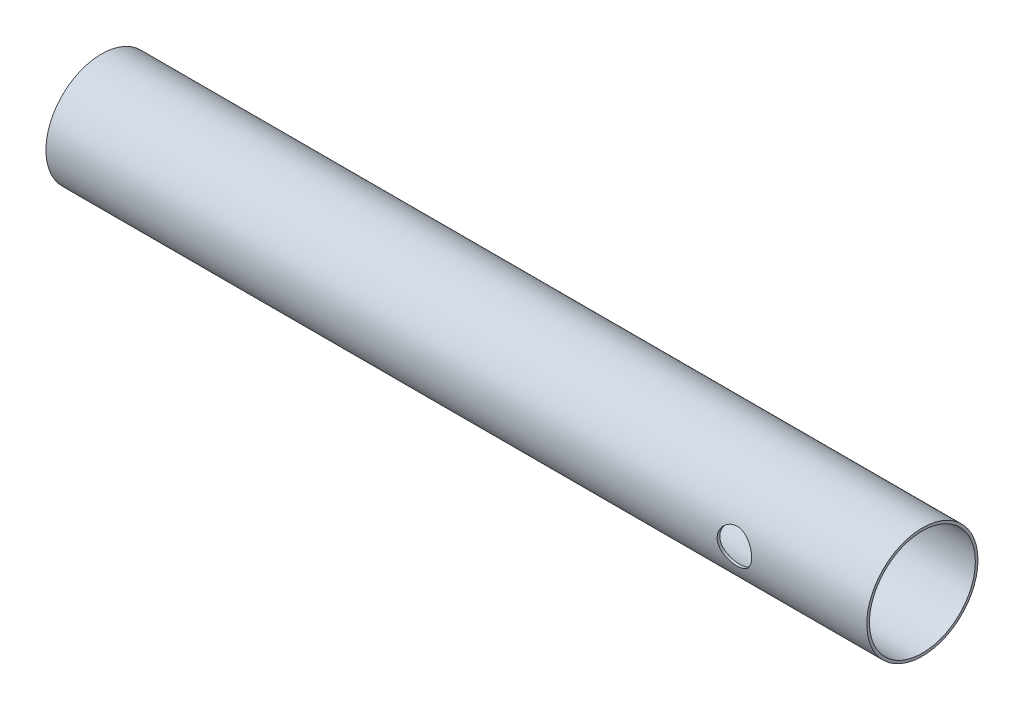
ISO-10303-21;
HEADER;
FILE_DESCRIPTION(('STEP AP214'),'2;1');
FILE_NAME('part.step','',(''),(''),'','','');
FILE_SCHEMA(('AUTOMOTIVE_DESIGN { 1 0 10303 214 1 1 1 1 }'));
ENDSEC;
DATA;
#1=APPLICATION_CONTEXT('core data for automotive mechanical design processes');
#2=APPLICATION_PROTOCOL_DEFINITION('international standard','automotive_design',2000,#1);
#3=PRODUCT_CONTEXT('',#1,'mechanical');
#4=PRODUCT('Part','Part','',(#3));
#5=PRODUCT_RELATED_PRODUCT_CATEGORY('part','',(#4));
#6=PRODUCT_DEFINITION_FORMATION('','',#4);
#7=PRODUCT_DEFINITION_CONTEXT('part definition',#1,'design');
#8=PRODUCT_DEFINITION('design','',#6,#7);
#9=PRODUCT_DEFINITION_SHAPE('','',#8);
#10=(LENGTH_UNIT() NAMED_UNIT(*) SI_UNIT(.MILLI.,.METRE.));
#11=(NAMED_UNIT(*) PLANE_ANGLE_UNIT() SI_UNIT($,.RADIAN.));
#12=(NAMED_UNIT(*) SI_UNIT($,.STERADIAN.) SOLID_ANGLE_UNIT());
#13=UNCERTAINTY_MEASURE_WITH_UNIT(LENGTH_MEASURE(1.E-05),#10,'distance_accuracy_value','');
#14=(GEOMETRIC_REPRESENTATION_CONTEXT(3) GLOBAL_UNCERTAINTY_ASSIGNED_CONTEXT((#13)) GLOBAL_UNIT_ASSIGNED_CONTEXT((#10,
#11,#12)) REPRESENTATION_CONTEXT('',''));
#15=CARTESIAN_POINT('',(0.,0.,0.));
#16=DIRECTION('',(0.,0.,1.));
#17=DIRECTION('',(1.,0.,0.));
#18=AXIS2_PLACEMENT_3D('',#15,#16,#17);
#19=CARTESIAN_POINT('',(155.,0.,0.));
#20=DIRECTION('',(-1.,0.,0.));
#21=DIRECTION('',(0.,0.,1.));
#22=AXIS2_PLACEMENT_3D('',#19,#20,#21);
#23=CYLINDRICAL_SURFACE('',#22,10.5);
#24=CARTESIAN_POINT('',(133.25,0.,10.5));
#25=CARTESIAN_POINT('',(133.249998588642,-0.178026372114683,10.4999989473875));
#26=CARTESIAN_POINT('',(133.235324008155,-0.356067266233827,10.4954295038703));
#27=CARTESIAN_POINT('',(133.177163748597,-0.706947680702037,10.477648459115));
#28=CARTESIAN_POINT('',(133.133671051026,-0.87978592325015,10.4644347526225));
#29=CARTESIAN_POINT('',(133.019477925502,-1.21515028632384,10.4308097366505));
#30=CARTESIAN_POINT('',(132.948819138157,-1.37769174793946,10.4104094468661));
#31=CARTESIAN_POINT('',(132.782475197975,-1.68861959265533,10.3645209928543));
#32=CARTESIAN_POINT('',(132.68678624693,-1.83700382279509,10.3390320565881));
#33=CARTESIAN_POINT('',(132.470039214364,-2.11991091652535,10.2848095354123));
#34=CARTESIAN_POINT('',(132.348358723693,-2.25394352316632,10.2560062627104));
#35=CARTESIAN_POINT('',(132.084408227129,-2.50006290958989,10.1988079102549));
#36=CARTESIAN_POINT('',(131.942134487326,-2.61214570080361,10.1704129055559));
#37=CARTESIAN_POINT('',(131.63681512754,-2.81382316474339,10.1165008483948));
#38=CARTESIAN_POINT('',(131.473350546752,-2.90280878355895,10.0910699499587));
#39=CARTESIAN_POINT('',(131.13286240627,-3.05182420724551,10.0470120335998));
#40=CARTESIAN_POINT('',(130.955842355163,-3.11186147571222,10.0283832622225));
#41=CARTESIAN_POINT('',(130.598794010913,-3.19948833674792,10.0007670986601));
#42=CARTESIAN_POINT('',(130.419009972375,-3.22798601978059,9.99151057206444));
#43=CARTESIAN_POINT('',(130.056992574875,-3.25456144124356,9.9828875016259));
#44=CARTESIAN_POINT('',(129.874759865282,-3.25264709163849,9.98351838548338));
#45=CARTESIAN_POINT('',(129.520498813248,-3.21916376566742,9.99436105817217));
#46=CARTESIAN_POINT('',(129.348348464851,-3.18874509897418,10.0042011829843));
#47=CARTESIAN_POINT('',(129.01172564143,-3.10098009892126,10.0317504291262));
#48=CARTESIAN_POINT('',(128.847253970264,-3.04363095320807,10.0494603722918));
#49=CARTESIAN_POINT('',(128.527899293932,-2.90281219039015,10.0910414628692));
#50=CARTESIAN_POINT('',(128.373188361295,-2.81897851680055,10.114997616242));
#51=CARTESIAN_POINT('',(128.0796508182,-2.6278233082916,10.1663324651609));
#52=CARTESIAN_POINT('',(127.940828281794,-2.52049576960876,10.1937120347791));
#53=CARTESIAN_POINT('',(127.676499867962,-2.27973834875872,10.2503036824501));
#54=CARTESIAN_POINT('',(127.55186430255,-2.14535763372981,10.2795430221295));
#55=CARTESIAN_POINT('',(127.326688212479,-1.85723848114465,10.3354812160032));
#56=CARTESIAN_POINT('',(127.226149405941,-1.70349866445774,10.3621798889637));
#57=CARTESIAN_POINT('',(127.051445964395,-1.37937125764263,10.410299837687));
#58=CARTESIAN_POINT('',(126.977485403831,-1.20886714194901,10.4316799063682));
#59=CARTESIAN_POINT('',(126.85955264682,-0.857022503079629,10.4664563745049));
#60=CARTESIAN_POINT('',(126.815571524155,-0.675685222926463,10.4798551501981));
#61=CARTESIAN_POINT('',(126.760320522258,-0.314711905558301,10.4967785597117));
#62=CARTESIAN_POINT('',(126.747872134173,-0.135272657071787,10.5006587586389));
#63=CARTESIAN_POINT('',(126.752721900864,0.223148167982401,10.4991573809981));
#64=CARTESIAN_POINT('',(126.770015801383,0.402129806338124,10.4937771290198));
#65=CARTESIAN_POINT('',(126.832911443861,0.750032657084894,10.4745928195124));
#66=CARTESIAN_POINT('',(126.877814982663,0.9190926561306,10.4609966704387));
#67=CARTESIAN_POINT('',(126.993806184175,1.24723439213312,10.4269670199232));
#68=CARTESIAN_POINT('',(127.064897061682,1.4063149011861,10.4065326790433));
#69=CARTESIAN_POINT('',(127.233161458042,1.71424289911668,10.3603191231677));
#70=CARTESIAN_POINT('',(127.330922021185,1.86275157974577,10.3344230146477));
#71=CARTESIAN_POINT('',(127.549044256415,2.1416528316608,10.2802500443723));
#72=CARTESIAN_POINT('',(127.669411947416,2.27204056230733,10.2519725497058));
#73=CARTESIAN_POINT('',(127.93487351901,2.51625143341151,10.1948434458966));
#74=CARTESIAN_POINT('',(128.080745943044,2.62923492870697,10.1660121705529));
#75=CARTESIAN_POINT('',(128.390006630196,2.82919090672849,10.1121925676158));
#76=CARTESIAN_POINT('',(128.55339456732,2.91616387344044,10.0872041685208));
#77=CARTESIAN_POINT('',(128.892663551589,3.06107474930478,10.0441797442307));
#78=CARTESIAN_POINT('',(129.068490206464,3.11913110782577,10.026115427651));
#79=CARTESIAN_POINT('',(129.428095057664,3.20461336457724,9.99912504077125));
#80=CARTESIAN_POINT('',(129.611870275676,3.2320506341949,9.99019557805107));
#81=CARTESIAN_POINT('',(129.973391378896,3.25470961820628,9.98283480440238));
#82=CARTESIAN_POINT('',(130.151043019524,3.25130662948557,9.98395529974795));
#83=CARTESIAN_POINT('',(130.503112301907,3.21569273774,9.99548210937387));
#84=CARTESIAN_POINT('',(130.677530088855,3.18348313126597,10.0058880057296));
#85=CARTESIAN_POINT('',(131.015772399104,3.09208317176439,10.0345029333151));
#86=CARTESIAN_POINT('',(131.179711531607,3.03327925876779,10.0525999853751));
#87=CARTESIAN_POINT('',(131.495527642991,2.89066329367506,10.0945314393948));
#88=CARTESIAN_POINT('',(131.647402194334,2.80684622469134,10.1183669921398));
#89=CARTESIAN_POINT('',(131.941102954121,2.6128101207099,10.1702341741673));
#90=CARTESIAN_POINT('',(132.082317654851,2.5016992787614,10.1983919711485));
#91=CARTESIAN_POINT('',(132.344542933405,2.25780755892426,10.2551430448143));
#92=CARTESIAN_POINT('',(132.465548129987,2.12502092791508,10.2837364352811));
#93=CARTESIAN_POINT('',(132.687769155922,1.83646273896603,10.3392280994172));
#94=CARTESIAN_POINT('',(132.788232922215,1.68009433011952,10.3660435029801));
#95=CARTESIAN_POINT('',(132.961311954316,1.35185780294834,10.413929219115));
#96=CARTESIAN_POINT('',(133.033938676516,1.17999609696949,10.4350018940844));
#97=CARTESIAN_POINT('',(133.143707078212,0.841629911408137,10.4674688133406));
#98=CARTESIAN_POINT('',(133.183453762287,0.676034935864816,10.4795633298216));
#99=CARTESIAN_POINT('',(133.236598349642,0.340297138273071,10.495828659941));
#100=CARTESIAN_POINT('',(133.250001348957,0.170155202264106,10.5000010060728));
#101=CARTESIAN_POINT('',(133.25,0.,10.5));
#102=B_SPLINE_CURVE_WITH_KNOTS('',3,(#24,#25,#26,#27,#28,#29,#30,#31,#32,#33,#34,#35,#36,#37,
#38,#39,#40,#41,#42,#43,#44,#45,#46,#47,#48,#49,#50,#51,#52,#53,#54,#55,#56,#57,#58,#59,#60,#61,
#62,#63,#64,#65,#66,#67,#68,#69,#70,#71,#72,#73,#74,#75,#76,#77,#78,#79,#80,#81,#82,#83,#84,#85,
#86,#87,#88,#89,#90,#91,#92,#93,#94,#95,#96,#97,#98,#99,#100,#101),.UNSPECIFIED.,.T.,.F.,(4,2,2,
2,2,2,2,2,2,2,2,2,2,2,2,2,2,2,2,2,2,2,2,2,2,2,2,2,2,2,2,2,2,2,2,2,2,2,4),(0.,0.533453781793642,
1.0670375312062,1.59980663502487,2.1326566309753,2.68008380374241,3.22761035908111,
3.78837138789629,4.3489877613352,4.89300520404593,5.43688111802954,5.95971252858562,
6.48259855064156,7.01301014854902,7.54355744959057,8.09777229599232,8.65202664668402,
9.21045008649311,9.76870718597261,10.3057697068359,10.8427554141218,11.3666903287102,
11.8906895837538,12.4273112753348,12.9640760399711,13.5216803146558,14.079274213181,
14.63456489308,15.1896492791568,15.7201062789506,16.2505394047216,16.7735008808056,
17.2965673178262,17.8397605151386,18.3830981202211,18.9437216866601,19.5041142789551,
20.0140808592655,20.5239487797395),.UNSPECIFIED.);
#103=CARTESIAN_POINT('',(133.25,0.,10.5));
#104=VERTEX_POINT('',#103);
#105=EDGE_CURVE('E57',#104,#104,#102,.T.);
#106=ORIENTED_EDGE('',*,*,#105,.T.);
#107=EDGE_LOOP('',(#106));
#108=FACE_BOUND('',#107,.T.);
#109=CARTESIAN_POINT('',(155.,0.,0.));
#110=DIRECTION('',(1.,0.,0.));
#111=DIRECTION('',(0.,0.,-1.));
#112=AXIS2_PLACEMENT_3D('',#109,#110,#111);
#113=CIRCLE('',#112,10.5);
#114=CARTESIAN_POINT('',(155.,0.,-10.5));
#115=VERTEX_POINT('',#114);
#116=EDGE_CURVE('E10',#115,#115,#113,.T.);
#117=ORIENTED_EDGE('',*,*,#116,.F.);
#118=EDGE_LOOP('',(#117));
#119=FACE_BOUND('',#118,.T.);
#120=CARTESIAN_POINT('',(0.,0.,0.));
#121=DIRECTION('',(1.,0.,0.));
#122=DIRECTION('',(0.,0.,-1.));
#123=AXIS2_PLACEMENT_3D('',#120,#121,#122);
#124=CIRCLE('',#123,10.5);
#125=CARTESIAN_POINT('',(0.,0.,-10.5));
#126=VERTEX_POINT('',#125);
#127=EDGE_CURVE('E47',#126,#126,#124,.T.);
#128=ORIENTED_EDGE('',*,*,#127,.T.);
#129=EDGE_LOOP('',(#128));
#130=FACE_BOUND('',#129,.T.);
#131=ADVANCED_FACE('F34',(#108,#119,#130),#23,.T.);
#132=CARTESIAN_POINT('',(155.,0.,0.));
#133=DIRECTION('',(1.,0.,0.));
#134=DIRECTION('',(0.,0.,-1.));
#135=AXIS2_PLACEMENT_3D('',#132,#133,#134);
#136=PLANE('',#135);
#137=CARTESIAN_POINT('',(155.,0.,0.));
#138=DIRECTION('',(1.,0.,0.));
#139=DIRECTION('',(0.,0.,-1.));
#140=AXIS2_PLACEMENT_3D('',#137,#138,#139);
#141=CIRCLE('',#140,10.);
#142=CARTESIAN_POINT('',(155.,0.,-10.));
#143=VERTEX_POINT('',#142);
#144=EDGE_CURVE('E54',#143,#143,#141,.T.);
#145=ORIENTED_EDGE('',*,*,#144,.F.);
#146=EDGE_LOOP('',(#145));
#147=FACE_BOUND('',#146,.T.);
#148=ORIENTED_EDGE('',*,*,#116,.T.);
#149=EDGE_LOOP('',(#148));
#150=FACE_BOUND('',#149,.T.);
#151=ADVANCED_FACE('F75',(#147,#150),#136,.T.);
#152=CARTESIAN_POINT('',(0.,0.,0.));
#153=DIRECTION('',(1.,0.,0.));
#154=DIRECTION('',(0.,0.,-1.));
#155=AXIS2_PLACEMENT_3D('',#152,#153,#154);
#156=PLANE('',#155);
#157=CARTESIAN_POINT('',(0.,0.,0.));
#158=DIRECTION('',(1.,0.,0.));
#159=DIRECTION('',(0.,0.,-1.));
#160=AXIS2_PLACEMENT_3D('',#157,#158,#159);
#161=CIRCLE('',#160,10.);
#162=CARTESIAN_POINT('',(0.,0.,-10.));
#163=VERTEX_POINT('',#162);
#164=EDGE_CURVE('E52',#163,#163,#161,.T.);
#165=ORIENTED_EDGE('',*,*,#164,.T.);
#166=EDGE_LOOP('',(#165));
#167=FACE_BOUND('',#166,.T.);
#168=ORIENTED_EDGE('',*,*,#127,.F.);
#169=EDGE_LOOP('',(#168));
#170=FACE_BOUND('',#169,.T.);
#171=ADVANCED_FACE('F73',(#167,#170),#156,.F.);
#172=CARTESIAN_POINT('',(0.,0.,0.));
#173=DIRECTION('',(1.,0.,0.));
#174=DIRECTION('',(0.,0.,-1.));
#175=AXIS2_PLACEMENT_3D('',#172,#173,#174);
#176=CYLINDRICAL_SURFACE('',#175,10.);
#177=CARTESIAN_POINT('',(133.25,0.,10.));
#178=CARTESIAN_POINT('',(133.249999978893,0.17757938294903,9.99999989374565));
#179=CARTESIAN_POINT('',(133.235398036528,0.355160799428107,9.99522579386108));
#180=CARTESIAN_POINT('',(133.177544333272,0.705108112257458,9.97665017824228));
#181=CARTESIAN_POINT('',(133.134288184761,0.877473205641292,9.96284727999529));
#182=CARTESIAN_POINT('',(133.020754772825,1.21189182680223,9.92771716006863));
#183=CARTESIAN_POINT('',(132.950521329808,1.37396158278685,9.90640214525769));
#184=CARTESIAN_POINT('',(132.785220348216,1.684022624021,9.85843361438871));
#185=CARTESIAN_POINT('',(132.690148299311,1.83201134569424,9.83177912896556));
#186=CARTESIAN_POINT('',(132.474558938708,2.11461081148199,9.77495932247796));
#187=CARTESIAN_POINT('',(132.353366806204,2.24869037174637,9.74471295358529));
#188=CARTESIAN_POINT('',(132.090413033913,2.49502344091046,9.68457368482561));
#189=CARTESIAN_POINT('',(131.94864716854,2.6072724549812,9.65468085893924));
#190=CARTESIAN_POINT('',(131.643862973249,2.80972801137823,9.59775056049016));
#191=CARTESIAN_POINT('',(131.480372950202,2.89925504445896,9.57081237727236));
#192=CARTESIAN_POINT('',(131.139640099792,3.04931887139799,9.52406830823477));
#193=CARTESIAN_POINT('',(130.962401250734,3.10986401524674,9.50426036852438));
#194=CARTESIAN_POINT('',(130.605224003478,3.19827260971519,9.4748706234853));
#195=CARTESIAN_POINT('',(130.425557170357,3.2271274104268,9.46497952226558));
#196=CARTESIAN_POINT('',(130.063681042994,3.25443459132068,9.45562707493594));
#197=CARTESIAN_POINT('',(129.881472504376,3.25289582251766,9.45616269242515));
#198=CARTESIAN_POINT('',(129.528034921642,3.22023155138038,9.46733131423128));
#199=CARTESIAN_POINT('',(129.356671424264,3.19038591816139,9.47752750417874));
#200=CARTESIAN_POINT('',(129.021530266182,3.10403782395807,9.50615574812355));
#201=CARTESIAN_POINT('',(128.85775347426,3.04753231830218,9.52458874278654));
#202=CARTESIAN_POINT('',(128.539469725231,2.90860404188741,9.56793440052134));
#203=CARTESIAN_POINT('',(128.385145941743,2.82579288678078,9.59294312913819));
#204=CARTESIAN_POINT('',(128.092174070327,2.63687365185911,9.64658062480913));
#205=CARTESIAN_POINT('',(127.953530344352,2.53075911343127,9.67521039451251));
#206=CARTESIAN_POINT('',(127.68864419467,2.29204406554378,9.73459644737762));
#207=CARTESIAN_POINT('',(127.56335456075,2.15839298888212,9.76538786414675));
#208=CARTESIAN_POINT('',(127.336724933833,1.87159594889807,9.82438470108507));
#209=CARTESIAN_POINT('',(127.235387016431,1.71844829781997,9.85258989700936));
#210=CARTESIAN_POINT('',(127.058820419637,1.3950599629623,9.90357541398692));
#211=CARTESIAN_POINT('',(126.983835581401,1.22467751353946,9.92630448856869));
#212=CARTESIAN_POINT('',(126.863882450901,0.872803501369052,9.96340575158468));
#213=CARTESIAN_POINT('',(126.818904268084,0.691315620659405,9.97778069343973));
#214=CARTESIAN_POINT('',(126.761902689586,0.330457295677709,9.99610319938068));
#215=CARTESIAN_POINT('',(126.748590876142,0.151310774152578,10.0004581918424));
#216=CARTESIAN_POINT('',(126.751644995372,-0.206684753642991,9.99946515119833));
#217=CARTESIAN_POINT('',(126.76800619627,-0.385533802797551,9.99411866512874));
#218=CARTESIAN_POINT('',(126.828916125414,-0.732777014929085,9.97459190888947));
#219=CARTESIAN_POINT('',(126.872683874118,-0.901323284372868,9.96065655544012));
#220=CARTESIAN_POINT('',(126.986197639871,-1.22862125569252,9.92560343144515));
#221=CARTESIAN_POINT('',(127.05594693378,-1.38737171915065,9.90448475494932));
#222=CARTESIAN_POINT('',(127.221427270234,-1.69509055480488,9.85654869030636));
#223=CARTESIAN_POINT('',(127.317776824875,-1.84370519348154,9.82959944293602));
#224=CARTESIAN_POINT('',(127.532989903973,-2.12308150730875,9.77306882676684));
#225=CARTESIAN_POINT('',(127.651859997817,-2.25383795390918,9.74348669127605));
#226=CARTESIAN_POINT('',(127.914800978044,-2.49964097258613,9.68341394517995));
#227=CARTESIAN_POINT('',(128.059736741237,-2.61376838975717,9.65293908057767));
#228=CARTESIAN_POINT('',(128.367361002655,-2.81618275812034,9.59584349220032));
#229=CARTESIAN_POINT('',(128.530049456706,-2.90446977360855,9.56922275883548));
#230=CARTESIAN_POINT('',(128.868452539395,-3.05222465357595,9.52312626728824));
#231=CARTESIAN_POINT('',(129.044128380463,-3.11177462835523,9.50363019104654));
#232=CARTESIAN_POINT('',(129.403787781573,-3.20020095668877,9.47422438151486));
#233=CARTESIAN_POINT('',(129.587767806332,-3.22909023717129,9.4643106083648));
#234=CARTESIAN_POINT('',(129.949140117443,-3.25439854839942,9.45563586870717));
#235=CARTESIAN_POINT('',(130.126414793097,-3.25233581624125,9.45635339998916));
#236=CARTESIAN_POINT('',(130.477953996167,-3.21950614466646,9.46758016662914));
#237=CARTESIAN_POINT('',(130.652218685805,-3.18874075712545,9.47808887260453));
#238=CARTESIAN_POINT('',(130.989832105728,-3.10043070730135,9.50733511912922));
#239=CARTESIAN_POINT('',(131.153316786779,-3.04335434275122,9.52592844913925));
#240=CARTESIAN_POINT('',(131.468517175449,-2.9044172299681,9.56920216910219));
#241=CARTESIAN_POINT('',(131.620230346504,-2.82255115849538,9.59388386623479));
#242=CARTESIAN_POINT('',(131.914456183463,-2.63235879697992,9.64784088636397));
#243=CARTESIAN_POINT('',(132.056318521375,-2.52306891129123,9.67726517521804));
#244=CARTESIAN_POINT('',(132.320180906983,-2.28278717900076,9.73674387050347));
#245=CARTESIAN_POINT('',(132.442175446629,-2.15178933442873,9.76679844907542));
#246=CARTESIAN_POINT('',(132.667296798218,-1.86608754817449,9.8254625209376));
#247=CARTESIAN_POINT('',(132.769576588143,-1.71069498742677,9.85397977542082));
#248=CARTESIAN_POINT('',(132.946440653677,-1.38400159009726,9.90514098282108));
#249=CARTESIAN_POINT('',(133.021033590156,-1.21270574929996,9.92778677175249));
#250=CARTESIAN_POINT('',(133.13633303599,-0.86983238069608,9.96349655119001));
#251=CARTESIAN_POINT('',(133.178827389201,-0.69890800347386,9.97706030755102));
#252=CARTESIAN_POINT('',(133.235657443572,-0.351988917437694,9.9953110007797));
#253=CARTESIAN_POINT('',(133.250000020918,-0.17599545742662,10.0000001053066));
#254=CARTESIAN_POINT('',(133.25,0.,10.));
#255=B_SPLINE_CURVE_WITH_KNOTS('',3,(#177,#178,#179,#180,#181,#182,#183,#184,#185,#186,#187,
#188,#189,#190,#191,#192,#193,#194,#195,#196,#197,#198,#199,#200,#201,#202,#203,#204,#205,#206,
#207,#208,#209,#210,#211,#212,#213,#214,#215,#216,#217,#218,#219,#220,#221,#222,#223,#224,#225,
#226,#227,#228,#229,#230,#231,#232,#233,#234,#235,#236,#237,#238,#239,#240,#241,#242,#243,#244,
#245,#246,#247,#248,#249,#250,#251,#252,#253,#254),.UNSPECIFIED.,.T.,.F.,(4,2,2,2,2,2,2,2,2,2,2,
2,2,2,2,2,2,2,2,2,2,2,2,2,2,2,2,2,2,2,2,2,2,2,2,2,2,2,4),(0.,0.532090801254678,1.06426309669592,
1.59557459199055,2.12698263287681,2.67425296309553,3.22163585524028,3.78384740278181,
4.34589687356043,4.88981368187708,5.43357209666658,5.9538611792341,6.47420969543027,
7.00262882865681,7.53119460031031,8.08590846442155,8.64067038102189,9.20043805582592,
9.7600211332091,10.2964148728263,10.8327230844865,11.3544036147969,11.8761499631049,
12.4112318399367,12.9464700445872,13.5047604456698,14.0630494576023,14.6197336846484,
15.176183113382,15.7054311330745,16.234650539404,16.7547941299287,17.275049493252,
17.8170673976499,18.3592353135957,18.9211107593865,19.4828102935623,20.0102839458812,
20.5376287446081),.UNSPECIFIED.);
#256=CARTESIAN_POINT('',(133.25,0.,10.));
#257=VERTEX_POINT('',#256);
#258=EDGE_CURVE('E38',#257,#257,#255,.T.);
#259=ORIENTED_EDGE('',*,*,#258,.T.);
#260=EDGE_LOOP('',(#259));
#261=FACE_BOUND('',#260,.T.);
#262=ORIENTED_EDGE('',*,*,#164,.F.);
#263=EDGE_LOOP('',(#262));
#264=FACE_BOUND('',#263,.T.);
#265=ORIENTED_EDGE('',*,*,#144,.T.);
#266=EDGE_LOOP('',(#265));
#267=FACE_BOUND('',#266,.T.);
#268=ADVANCED_FACE('F67',(#261,#264,#267),#176,.F.);
#269=CARTESIAN_POINT('',(130.,0.,7.86997080694933));
#270=DIRECTION('',(0.,0.,1.));
#271=DIRECTION('',(1.,0.,0.));
#272=AXIS2_PLACEMENT_3D('',#269,#270,#271);
#273=CYLINDRICAL_SURFACE('',#272,3.25000000000001);
#274=ORIENTED_EDGE('',*,*,#258,.F.);
#275=EDGE_LOOP('',(#274));
#276=FACE_BOUND('',#275,.T.);
#277=ORIENTED_EDGE('',*,*,#105,.F.);
#278=EDGE_LOOP('',(#277));
#279=FACE_BOUND('',#278,.T.);
#280=ADVANCED_FACE('F64',(#276,#279),#273,.F.);
#281=CLOSED_SHELL('',(#131,#151,#171,#268,#280));
#282=MANIFOLD_SOLID_BREP('B2',#281);
#283=ADVANCED_BREP_SHAPE_REPRESENTATION('',(#18,#282),#14);
#284=SHAPE_DEFINITION_REPRESENTATION(#9,#283);
ENDSEC;
END-ISO-10303-21;
